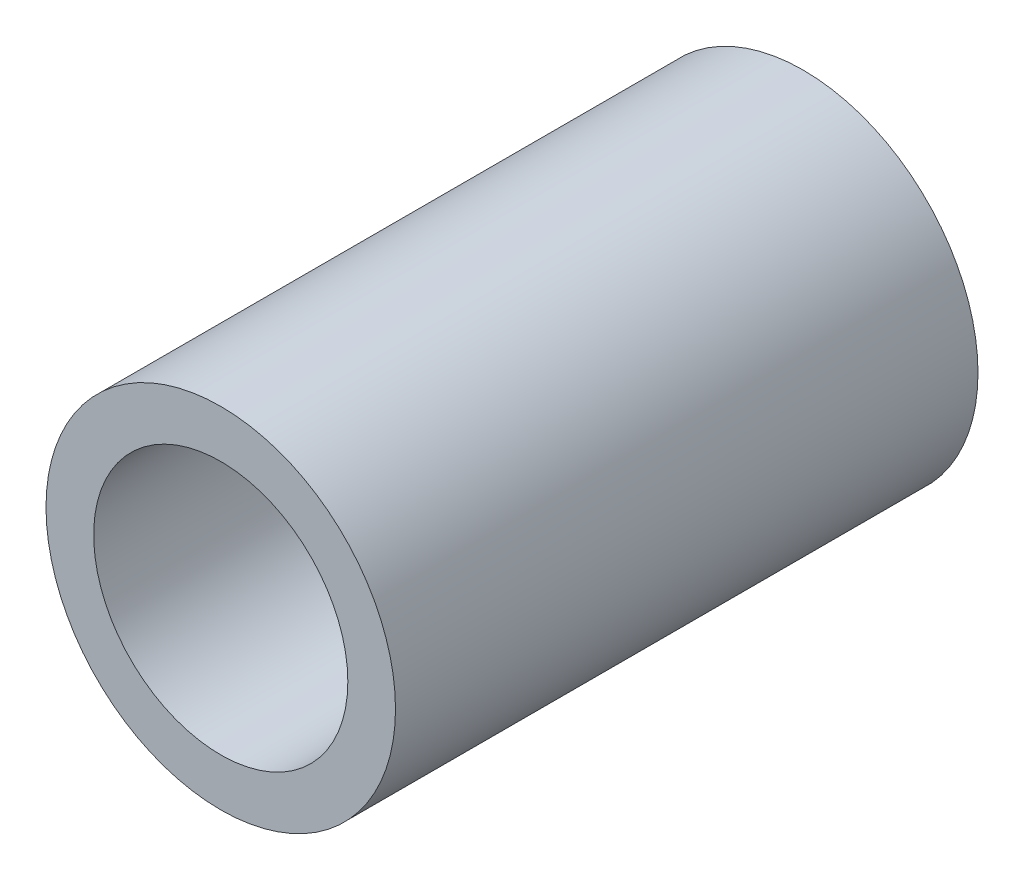
ISO-10303-21;
HEADER;
FILE_DESCRIPTION(('STEP AP214'),'2;1');
FILE_NAME('part.step','',(''),(''),'','','');
FILE_SCHEMA(('AUTOMOTIVE_DESIGN { 1 0 10303 214 1 1 1 1 }'));
ENDSEC;
DATA;
#1=APPLICATION_CONTEXT('core data for automotive mechanical design processes');
#2=APPLICATION_PROTOCOL_DEFINITION('international standard','automotive_design',2000,#1);
#3=PRODUCT_CONTEXT('',#1,'mechanical');
#4=PRODUCT('Part','Part','',(#3));
#5=PRODUCT_RELATED_PRODUCT_CATEGORY('part','',(#4));
#6=PRODUCT_DEFINITION_FORMATION('','',#4);
#7=PRODUCT_DEFINITION_CONTEXT('part definition',#1,'design');
#8=PRODUCT_DEFINITION('design','',#6,#7);
#9=PRODUCT_DEFINITION_SHAPE('','',#8);
#10=(LENGTH_UNIT() NAMED_UNIT(*) SI_UNIT(.MILLI.,.METRE.));
#11=(NAMED_UNIT(*) PLANE_ANGLE_UNIT() SI_UNIT($,.RADIAN.));
#12=(NAMED_UNIT(*) SI_UNIT($,.STERADIAN.) SOLID_ANGLE_UNIT());
#13=UNCERTAINTY_MEASURE_WITH_UNIT(LENGTH_MEASURE(1.E-05),#10,'distance_accuracy_value','');
#14=(GEOMETRIC_REPRESENTATION_CONTEXT(3) GLOBAL_UNCERTAINTY_ASSIGNED_CONTEXT((#13)) GLOBAL_UNIT_ASSIGNED_CONTEXT((#10,
#11,#12)) REPRESENTATION_CONTEXT('',''));
#15=CARTESIAN_POINT('',(0.,0.,0.));
#16=DIRECTION('',(0.,0.,1.));
#17=DIRECTION('',(1.,0.,0.));
#18=AXIS2_PLACEMENT_3D('',#15,#16,#17);
#19=CARTESIAN_POINT('',(0.,0.,10.));
#20=DIRECTION('',(0.,0.,1.));
#21=DIRECTION('',(1.,0.,0.));
#22=AXIS2_PLACEMENT_3D('',#19,#20,#21);
#23=PLANE('',#22);
#24=CARTESIAN_POINT('',(0.,0.,10.));
#25=DIRECTION('',(0.,0.,1.));
#26=DIRECTION('',(1.,0.,0.));
#27=AXIS2_PLACEMENT_3D('',#24,#25,#26);
#28=CIRCLE('',#27,3.);
#29=CARTESIAN_POINT('',(3.,0.,10.));
#30=VERTEX_POINT('',#29);
#31=EDGE_CURVE('E10',#30,#30,#28,.T.);
#32=ORIENTED_EDGE('',*,*,#31,.T.);
#33=EDGE_LOOP('',(#32));
#34=FACE_BOUND('',#33,.T.);
#35=CARTESIAN_POINT('',(0.,0.,10.));
#36=DIRECTION('',(0.,0.,1.));
#37=DIRECTION('',(1.,0.,0.));
#38=AXIS2_PLACEMENT_3D('',#35,#36,#37);
#39=CIRCLE('',#38,2.18181818181818);
#40=CARTESIAN_POINT('',(2.18181818181818,0.,10.));
#41=VERTEX_POINT('',#40);
#42=EDGE_CURVE('E47',#41,#41,#39,.T.);
#43=ORIENTED_EDGE('',*,*,#42,.F.);
#44=EDGE_LOOP('',(#43));
#45=FACE_BOUND('',#44,.T.);
#46=ADVANCED_FACE('F36',(#34,#45),#23,.T.);
#47=CARTESIAN_POINT('',(0.,0.,0.));
#48=DIRECTION('',(0.,0.,1.));
#49=DIRECTION('',(1.,0.,0.));
#50=AXIS2_PLACEMENT_3D('',#47,#48,#49);
#51=PLANE('',#50);
#52=CARTESIAN_POINT('',(0.,0.,0.));
#53=DIRECTION('',(0.,0.,1.));
#54=DIRECTION('',(1.,0.,0.));
#55=AXIS2_PLACEMENT_3D('',#52,#53,#54);
#56=CIRCLE('',#55,3.);
#57=CARTESIAN_POINT('',(3.,0.,0.));
#58=VERTEX_POINT('',#57);
#59=EDGE_CURVE('E40',#58,#58,#56,.T.);
#60=ORIENTED_EDGE('',*,*,#59,.F.);
#61=EDGE_LOOP('',(#60));
#62=FACE_BOUND('',#61,.T.);
#63=CARTESIAN_POINT('',(0.,0.,0.));
#64=DIRECTION('',(0.,0.,1.));
#65=DIRECTION('',(1.,0.,0.));
#66=AXIS2_PLACEMENT_3D('',#63,#64,#65);
#67=CIRCLE('',#66,2.18181818181818);
#68=CARTESIAN_POINT('',(2.18181818181818,0.,0.));
#69=VERTEX_POINT('',#68);
#70=EDGE_CURVE('E49',#69,#69,#67,.T.);
#71=ORIENTED_EDGE('',*,*,#70,.T.);
#72=EDGE_LOOP('',(#71));
#73=FACE_BOUND('',#72,.T.);
#74=ADVANCED_FACE('F59',(#62,#73),#51,.F.);
#75=CARTESIAN_POINT('',(0.,0.,10.));
#76=DIRECTION('',(0.,0.,-1.));
#77=DIRECTION('',(-1.,0.,0.));
#78=AXIS2_PLACEMENT_3D('',#75,#76,#77);
#79=CYLINDRICAL_SURFACE('',#78,3.);
#80=ORIENTED_EDGE('',*,*,#31,.F.);
#81=EDGE_LOOP('',(#80));
#82=FACE_BOUND('',#81,.T.);
#83=ORIENTED_EDGE('',*,*,#59,.T.);
#84=EDGE_LOOP('',(#83));
#85=FACE_BOUND('',#84,.T.);
#86=ADVANCED_FACE('F38',(#82,#85),#79,.T.);
#87=CARTESIAN_POINT('',(0.,0.,10.));
#88=DIRECTION('',(0.,0.,-1.));
#89=DIRECTION('',(-1.,0.,0.));
#90=AXIS2_PLACEMENT_3D('',#87,#88,#89);
#91=CYLINDRICAL_SURFACE('',#90,2.18181818181818);
#92=ORIENTED_EDGE('',*,*,#42,.T.);
#93=EDGE_LOOP('',(#92));
#94=FACE_BOUND('',#93,.T.);
#95=ORIENTED_EDGE('',*,*,#70,.F.);
#96=EDGE_LOOP('',(#95));
#97=FACE_BOUND('',#96,.T.);
#98=ADVANCED_FACE('F55',(#94,#97),#91,.F.);
#99=CLOSED_SHELL('',(#46,#74,#86,#98));
#100=MANIFOLD_SOLID_BREP('B2',#99);
#101=ADVANCED_BREP_SHAPE_REPRESENTATION('',(#18,#100),#14);
#102=SHAPE_DEFINITION_REPRESENTATION(#9,#101);
ENDSEC;
END-ISO-10303-21;
